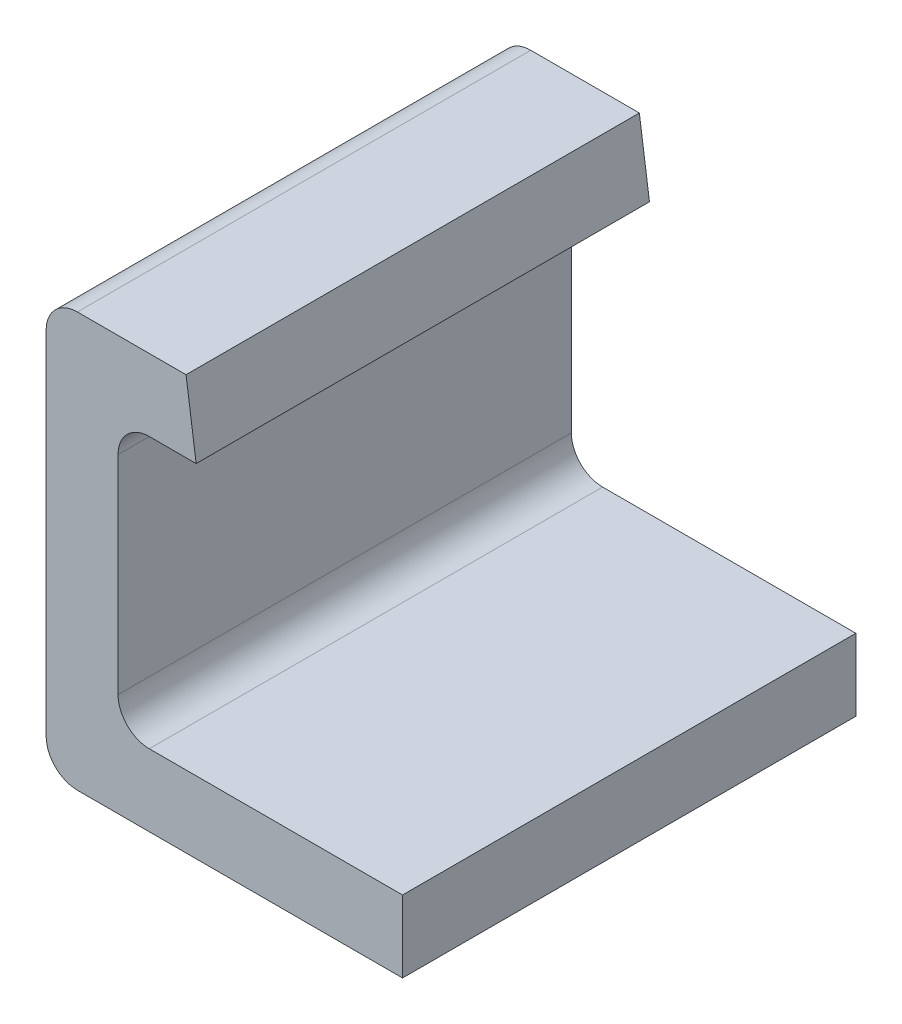
ISO-10303-21;
HEADER;
FILE_DESCRIPTION(('STEP AP214'),'2;1');
FILE_NAME('part.step','',(''),(''),'','','');
FILE_SCHEMA(('AUTOMOTIVE_DESIGN { 1 0 10303 214 1 1 1 1 }'));
ENDSEC;
DATA;
#1=APPLICATION_CONTEXT('core data for automotive mechanical design processes');
#2=APPLICATION_PROTOCOL_DEFINITION('international standard','automotive_design',2000,#1);
#3=PRODUCT_CONTEXT('',#1,'mechanical');
#4=PRODUCT('Part','Part','',(#3));
#5=PRODUCT_RELATED_PRODUCT_CATEGORY('part','',(#4));
#6=PRODUCT_DEFINITION_FORMATION('','',#4);
#7=PRODUCT_DEFINITION_CONTEXT('part definition',#1,'design');
#8=PRODUCT_DEFINITION('design','',#6,#7);
#9=PRODUCT_DEFINITION_SHAPE('','',#8);
#10=(LENGTH_UNIT() NAMED_UNIT(*) SI_UNIT(.MILLI.,.METRE.));
#11=(NAMED_UNIT(*) PLANE_ANGLE_UNIT() SI_UNIT($,.RADIAN.));
#12=(NAMED_UNIT(*) SI_UNIT($,.STERADIAN.) SOLID_ANGLE_UNIT());
#13=UNCERTAINTY_MEASURE_WITH_UNIT(LENGTH_MEASURE(1.E-05),#10,'distance_accuracy_value','');
#14=(GEOMETRIC_REPRESENTATION_CONTEXT(3) GLOBAL_UNCERTAINTY_ASSIGNED_CONTEXT((#13)) GLOBAL_UNIT_ASSIGNED_CONTEXT((#10,
#11,#12)) REPRESENTATION_CONTEXT('',''));
#15=CARTESIAN_POINT('',(0.,0.,0.));
#16=DIRECTION('',(0.,0.,1.));
#17=DIRECTION('',(1.,0.,0.));
#18=AXIS2_PLACEMENT_3D('',#15,#16,#17);
#19=CARTESIAN_POINT('',(0.10625,0.3325,0.));
#20=DIRECTION('',(0.,0.,-1.));
#21=DIRECTION('',(-1.,0.,0.));
#22=AXIS2_PLACEMENT_3D('',#19,#20,#21);
#23=CYLINDRICAL_SURFACE('',#22,0.1);
#24=DIRECTION('',(0.,0.,1.));
#25=VECTOR('',#24,1.);
#26=CARTESIAN_POINT('',(0.10625,0.4325,0.));
#27=LINE('',#26,#25);
#28=CARTESIAN_POINT('',(0.10625,0.4325,-1.45));
#29=VERTEX_POINT('',#28);
#30=CARTESIAN_POINT('',(0.10625,0.4325,0.));
#31=VERTEX_POINT('',#30);
#32=EDGE_CURVE('E213',#29,#31,#27,.T.);
#33=ORIENTED_EDGE('',*,*,#32,.T.);
#34=CARTESIAN_POINT('',(0.10625,0.3325,0.));
#35=DIRECTION('',(0.,0.,-1.));
#36=DIRECTION('',(-1.,0.,0.));
#37=AXIS2_PLACEMENT_3D('',#34,#35,#36);
#38=CIRCLE('',#37,0.1);
#39=CARTESIAN_POINT('',(0.00625,0.3325,0.));
#40=VERTEX_POINT('',#39);
#41=EDGE_CURVE('E20',#40,#31,#38,.T.);
#42=ORIENTED_EDGE('',*,*,#41,.F.);
#43=DIRECTION('',(0.,0.,1.));
#44=VECTOR('',#43,1.);
#45=CARTESIAN_POINT('',(0.00625,0.3325,0.));
#46=LINE('',#45,#44);
#47=CARTESIAN_POINT('',(0.00625,0.3325,-1.45));
#48=VERTEX_POINT('',#47);
#49=EDGE_CURVE('E216',#40,#48,#46,.F.);
#50=ORIENTED_EDGE('',*,*,#49,.T.);
#51=CARTESIAN_POINT('',(0.10625,0.3325,-1.45));
#52=DIRECTION('',(0.,0.,-1.));
#53=DIRECTION('',(-1.,0.,0.));
#54=AXIS2_PLACEMENT_3D('',#51,#52,#53);
#55=CIRCLE('',#54,0.1);
#56=EDGE_CURVE('E225',#29,#48,#55,.F.);
#57=ORIENTED_EDGE('',*,*,#56,.F.);
#58=EDGE_LOOP('',(#33,#42,#50,#57));
#59=FACE_BOUND('',#58,.T.);
#60=ADVANCED_FACE('F17',(#59),#23,.F.);
#61=CARTESIAN_POINT('',(-0.22375,0.4325,0.));
#62=DIRECTION('',(0.,1.,0.));
#63=DIRECTION('',(0.,0.,1.));
#64=AXIS2_PLACEMENT_3D('',#61,#62,#63);
#65=PLANE('',#64);
#66=DIRECTION('',(1.,0.,0.));
#67=VECTOR('',#66,1.);
#68=CARTESIAN_POINT('',(-0.22375,0.4325,-1.45));
#69=LINE('',#68,#67);
#70=CARTESIAN_POINT('',(0.256074391981687,0.432499999999956,-1.45));
#71=VERTEX_POINT('',#70);
#72=EDGE_CURVE('E94',#71,#29,#69,.F.);
#73=ORIENTED_EDGE('',*,*,#72,.F.);
#74=DIRECTION('',(0.,0.,1.));
#75=VECTOR('',#74,1.);
#76=CARTESIAN_POINT('',(0.25607439198153,0.432499999999934,-1.45));
#77=LINE('',#76,#75);
#78=CARTESIAN_POINT('',(0.256074391981687,0.432499999999956,0.));
#79=VERTEX_POINT('',#78);
#80=EDGE_CURVE('E204',#71,#79,#77,.T.);
#81=ORIENTED_EDGE('',*,*,#80,.T.);
#82=DIRECTION('',(1.,0.,0.));
#83=VECTOR('',#82,1.);
#84=CARTESIAN_POINT('',(-0.22375,0.4325,0.));
#85=LINE('',#84,#83);
#86=EDGE_CURVE('E221',#31,#79,#85,.T.);
#87=ORIENTED_EDGE('',*,*,#86,.F.);
#88=ORIENTED_EDGE('',*,*,#32,.F.);
#89=EDGE_LOOP('',(#73,#81,#87,#88));
#90=FACE_BOUND('',#89,.T.);
#91=ADVANCED_FACE('F239',(#90),#65,.F.);
#92=CARTESIAN_POINT('',(0.00625,-0.6625,0.));
#93=DIRECTION('',(-1.,0.,0.));
#94=DIRECTION('',(0.,0.,1.));
#95=AXIS2_PLACEMENT_3D('',#92,#93,#94);
#96=PLANE('',#95);
#97=DIRECTION('',(0.,1.,0.));
#98=VECTOR('',#97,1.);
#99=CARTESIAN_POINT('',(0.00625,-0.6625,0.));
#100=LINE('',#99,#98);
#101=CARTESIAN_POINT('',(0.00624999999999999,-0.3325,0.));
#102=VERTEX_POINT('',#101);
#103=EDGE_CURVE('E212',#102,#40,#100,.T.);
#104=ORIENTED_EDGE('',*,*,#103,.F.);
#105=DIRECTION('',(0.,0.,-1.));
#106=VECTOR('',#105,1.);
#107=CARTESIAN_POINT('',(0.00624999999999998,-0.3325,0.));
#108=LINE('',#107,#106);
#109=CARTESIAN_POINT('',(0.00624999999999999,-0.3325,-1.45));
#110=VERTEX_POINT('',#109);
#111=EDGE_CURVE('E207',#102,#110,#108,.T.);
#112=ORIENTED_EDGE('',*,*,#111,.T.);
#113=DIRECTION('',(0.,1.,0.));
#114=VECTOR('',#113,1.);
#115=CARTESIAN_POINT('',(0.00625,-0.6625,-1.45));
#116=LINE('',#115,#114);
#117=EDGE_CURVE('E210',#48,#110,#116,.F.);
#118=ORIENTED_EDGE('',*,*,#117,.F.);
#119=ORIENTED_EDGE('',*,*,#49,.F.);
#120=EDGE_LOOP('',(#104,#112,#118,#119));
#121=FACE_BOUND('',#120,.T.);
#122=ADVANCED_FACE('F290',(#121),#96,.F.);
#123=CARTESIAN_POINT('',(0.22375,0.6625,-1.45));
#124=DIRECTION('',(-0.990268068741588,-0.139173100959942,0.));
#125=DIRECTION('',(0.139173100959942,-0.990268068741588,0.));
#126=AXIS2_PLACEMENT_3D('',#123,#124,#125);
#127=PLANE('',#126);
#128=DIRECTION('',(0.,0.,-1.));
#129=VECTOR('',#128,1.);
#130=CARTESIAN_POINT('',(0.22375,0.6625,0.));
#131=LINE('',#130,#129);
#132=CARTESIAN_POINT('',(0.22375,0.6625,-1.45));
#133=VERTEX_POINT('',#132);
#134=CARTESIAN_POINT('',(0.22375,0.6625,0.));
#135=VERTEX_POINT('',#134);
#136=EDGE_CURVE('E124',#133,#135,#131,.F.);
#137=ORIENTED_EDGE('',*,*,#136,.T.);
#138=DIRECTION('',(0.139173100959942,-0.990268068741588,0.));
#139=VECTOR('',#138,1.);
#140=CARTESIAN_POINT('',(0.22375,0.6625,0.));
#141=LINE('',#140,#139);
#142=EDGE_CURVE('E200',#79,#135,#141,.F.);
#143=ORIENTED_EDGE('',*,*,#142,.F.);
#144=ORIENTED_EDGE('',*,*,#80,.F.);
#145=DIRECTION('',(0.139173100959942,-0.990268068741588,0.));
#146=VECTOR('',#145,1.);
#147=CARTESIAN_POINT('',(0.22375,0.6625,-1.45));
#148=LINE('',#147,#146);
#149=EDGE_CURVE('E196',#133,#71,#148,.T.);
#150=ORIENTED_EDGE('',*,*,#149,.F.);
#151=EDGE_LOOP('',(#137,#143,#144,#150));
#152=FACE_BOUND('',#151,.T.);
#153=ADVANCED_FACE('F245',(#152),#127,.F.);
#154=CARTESIAN_POINT('',(0.10625,-0.3325,0.));
#155=DIRECTION('',(0.,0.,-1.));
#156=DIRECTION('',(-1.,0.,0.));
#157=AXIS2_PLACEMENT_3D('',#154,#155,#156);
#158=CYLINDRICAL_SURFACE('',#157,0.1);
#159=ORIENTED_EDGE('',*,*,#111,.F.);
#160=CARTESIAN_POINT('',(0.10625,-0.3325,0.));
#161=DIRECTION('',(0.,0.,-1.));
#162=DIRECTION('',(-1.,0.,0.));
#163=AXIS2_PLACEMENT_3D('',#160,#161,#162);
#164=CIRCLE('',#163,0.1);
#165=CARTESIAN_POINT('',(0.10625,-0.4325,0.));
#166=VERTEX_POINT('',#165);
#167=EDGE_CURVE('E199',#166,#102,#164,.T.);
#168=ORIENTED_EDGE('',*,*,#167,.F.);
#169=DIRECTION('',(0.,0.,-1.));
#170=VECTOR('',#169,1.);
#171=CARTESIAN_POINT('',(0.10625,-0.4325,0.));
#172=LINE('',#171,#170);
#173=CARTESIAN_POINT('',(0.10625,-0.4325,-1.45));
#174=VERTEX_POINT('',#173);
#175=EDGE_CURVE('E133',#166,#174,#172,.T.);
#176=ORIENTED_EDGE('',*,*,#175,.T.);
#177=CARTESIAN_POINT('',(0.10625,-0.3325,-1.45));
#178=DIRECTION('',(0.,0.,-1.));
#179=DIRECTION('',(-1.,0.,0.));
#180=AXIS2_PLACEMENT_3D('',#177,#178,#179);
#181=CIRCLE('',#180,0.1);
#182=EDGE_CURVE('E193',#110,#174,#181,.F.);
#183=ORIENTED_EDGE('',*,*,#182,.F.);
#184=EDGE_LOOP('',(#159,#168,#176,#183));
#185=FACE_BOUND('',#184,.T.);
#186=ADVANCED_FACE('F284',(#185),#158,.F.);
#187=CARTESIAN_POINT('',(0.91625,-0.6625,0.));
#188=DIRECTION('',(-1.,0.,0.));
#189=DIRECTION('',(0.,0.,1.));
#190=AXIS2_PLACEMENT_3D('',#187,#188,#189);
#191=PLANE('',#190);
#192=DIRECTION('',(0.,0.,1.));
#193=VECTOR('',#192,1.);
#194=CARTESIAN_POINT('',(0.91625,-0.6625,0.));
#195=LINE('',#194,#193);
#196=CARTESIAN_POINT('',(0.91625,-0.6625,0.));
#197=VERTEX_POINT('',#196);
#198=CARTESIAN_POINT('',(0.91625,-0.6625,-1.45));
#199=VERTEX_POINT('',#198);
#200=EDGE_CURVE('E170',#197,#199,#195,.F.);
#201=ORIENTED_EDGE('',*,*,#200,.T.);
#202=DIRECTION('',(0.,1.,0.));
#203=VECTOR('',#202,1.);
#204=CARTESIAN_POINT('',(0.91625,-0.6625,-1.45));
#205=LINE('',#204,#203);
#206=CARTESIAN_POINT('',(0.91625,-0.4325,-1.45));
#207=VERTEX_POINT('',#206);
#208=EDGE_CURVE('E125',#207,#199,#205,.F.);
#209=ORIENTED_EDGE('',*,*,#208,.F.);
#210=DIRECTION('',(0.,0.,-1.));
#211=VECTOR('',#210,1.);
#212=CARTESIAN_POINT('',(0.91625,-0.4325,0.));
#213=LINE('',#212,#211);
#214=CARTESIAN_POINT('',(0.91625,-0.4325,0.));
#215=VERTEX_POINT('',#214);
#216=EDGE_CURVE('E128',#207,#215,#213,.F.);
#217=ORIENTED_EDGE('',*,*,#216,.T.);
#218=DIRECTION('',(0.,1.,0.));
#219=VECTOR('',#218,1.);
#220=CARTESIAN_POINT('',(0.91625,-0.6625,0.));
#221=LINE('',#220,#219);
#222=EDGE_CURVE('E113',#197,#215,#221,.T.);
#223=ORIENTED_EDGE('',*,*,#222,.F.);
#224=EDGE_LOOP('',(#201,#209,#217,#223));
#225=FACE_BOUND('',#224,.T.);
#226=ADVANCED_FACE('F129',(#225),#191,.F.);
#227=CARTESIAN_POINT('',(0.22375,0.6625,0.));
#228=DIRECTION('',(0.,-1.,0.));
#229=DIRECTION('',(0.,0.,-1.));
#230=AXIS2_PLACEMENT_3D('',#227,#228,#229);
#231=PLANE('',#230);
#232=DIRECTION('',(1.,0.,0.));
#233=VECTOR('',#232,1.);
#234=CARTESIAN_POINT('',(0.22375,0.6625,0.));
#235=LINE('',#234,#233);
#236=CARTESIAN_POINT('',(-0.12375,0.6625,0.));
#237=VERTEX_POINT('',#236);
#238=EDGE_CURVE('E134',#135,#237,#235,.F.);
#239=ORIENTED_EDGE('',*,*,#238,.F.);
#240=ORIENTED_EDGE('',*,*,#136,.F.);
#241=DIRECTION('',(1.,0.,0.));
#242=VECTOR('',#241,1.);
#243=CARTESIAN_POINT('',(0.,0.6625,-1.45));
#244=LINE('',#243,#242);
#245=CARTESIAN_POINT('',(-0.12375,0.6625,-1.45));
#246=VERTEX_POINT('',#245);
#247=EDGE_CURVE('E158',#133,#246,#244,.F.);
#248=ORIENTED_EDGE('',*,*,#247,.T.);
#249=DIRECTION('',(0.,0.,1.));
#250=VECTOR('',#249,1.);
#251=CARTESIAN_POINT('',(-0.12375,0.6625,0.));
#252=LINE('',#251,#250);
#253=EDGE_CURVE('E143',#237,#246,#252,.F.);
#254=ORIENTED_EDGE('',*,*,#253,.F.);
#255=EDGE_LOOP('',(#239,#240,#248,#254));
#256=FACE_BOUND('',#255,.T.);
#257=ADVANCED_FACE('F248',(#256),#231,.F.);
#258=CARTESIAN_POINT('',(0.91625,-0.4325,0.));
#259=DIRECTION('',(0.,-1.,0.));
#260=DIRECTION('',(0.,0.,-1.));
#261=AXIS2_PLACEMENT_3D('',#258,#259,#260);
#262=PLANE('',#261);
#263=DIRECTION('',(1.,0.,0.));
#264=VECTOR('',#263,1.);
#265=CARTESIAN_POINT('',(0.,-0.4325,0.));
#266=LINE('',#265,#264);
#267=EDGE_CURVE('E118',#215,#166,#266,.F.);
#268=ORIENTED_EDGE('',*,*,#267,.F.);
#269=ORIENTED_EDGE('',*,*,#216,.F.);
#270=DIRECTION('',(1.,0.,0.));
#271=VECTOR('',#270,1.);
#272=CARTESIAN_POINT('',(0.,-0.4325,-1.45));
#273=LINE('',#272,#271);
#274=EDGE_CURVE('E161',#207,#174,#273,.F.);
#275=ORIENTED_EDGE('',*,*,#274,.T.);
#276=ORIENTED_EDGE('',*,*,#175,.F.);
#277=EDGE_LOOP('',(#268,#269,#275,#276));
#278=FACE_BOUND('',#277,.T.);
#279=ADVANCED_FACE('F137',(#278),#262,.F.);
#280=CARTESIAN_POINT('',(-0.22375,-0.6625,0.));
#281=DIRECTION('',(0.,1.,0.));
#282=DIRECTION('',(0.,0.,1.));
#283=AXIS2_PLACEMENT_3D('',#280,#281,#282);
#284=PLANE('',#283);
#285=DIRECTION('',(1.,0.,0.));
#286=VECTOR('',#285,1.);
#287=CARTESIAN_POINT('',(0.,-0.6625,-1.45));
#288=LINE('',#287,#286);
#289=CARTESIAN_POINT('',(-0.12375,-0.6625,-1.45));
#290=VERTEX_POINT('',#289);
#291=EDGE_CURVE('E165',#290,#199,#288,.T.);
#292=ORIENTED_EDGE('',*,*,#291,.T.);
#293=ORIENTED_EDGE('',*,*,#200,.F.);
#294=DIRECTION('',(1.,0.,0.));
#295=VECTOR('',#294,1.);
#296=CARTESIAN_POINT('',(0.,-0.6625,0.));
#297=LINE('',#296,#295);
#298=CARTESIAN_POINT('',(-0.12375,-0.6625,0.));
#299=VERTEX_POINT('',#298);
#300=EDGE_CURVE('E120',#299,#197,#297,.T.);
#301=ORIENTED_EDGE('',*,*,#300,.F.);
#302=DIRECTION('',(0.,0.,1.));
#303=VECTOR('',#302,1.);
#304=CARTESIAN_POINT('',(-0.12375,-0.6625,0.));
#305=LINE('',#304,#303);
#306=EDGE_CURVE('E173',#290,#299,#305,.T.);
#307=ORIENTED_EDGE('',*,*,#306,.F.);
#308=EDGE_LOOP('',(#292,#293,#301,#307));
#309=FACE_BOUND('',#308,.T.);
#310=ADVANCED_FACE('F274',(#309),#284,.F.);
#311=CARTESIAN_POINT('',(0.,0.5475,-1.45));
#312=DIRECTION('',(0.,0.,1.));
#313=DIRECTION('',(1.,0.,0.));
#314=AXIS2_PLACEMENT_3D('',#311,#312,#313);
#315=PLANE('',#314);
#316=DIRECTION('',(0.,1.,0.));
#317=VECTOR('',#316,1.);
#318=CARTESIAN_POINT('',(-0.22375,0.6625,-1.45));
#319=LINE('',#318,#317);
#320=CARTESIAN_POINT('',(-0.22375,-0.5625,-1.45));
#321=VERTEX_POINT('',#320);
#322=CARTESIAN_POINT('',(-0.22375,0.5625,-1.45));
#323=VERTEX_POINT('',#322);
#324=EDGE_CURVE('E153',#321,#323,#319,.T.);
#325=ORIENTED_EDGE('',*,*,#324,.T.);
#326=CARTESIAN_POINT('',(-0.12375,0.5625,-1.45));
#327=DIRECTION('',(0.,0.,1.));
#328=DIRECTION('',(1.,0.,0.));
#329=AXIS2_PLACEMENT_3D('',#326,#327,#328);
#330=CIRCLE('',#329,0.1);
#331=EDGE_CURVE('E160',#246,#323,#330,.T.);
#332=ORIENTED_EDGE('',*,*,#331,.F.);
#333=ORIENTED_EDGE('',*,*,#247,.F.);
#334=ORIENTED_EDGE('',*,*,#149,.T.);
#335=ORIENTED_EDGE('',*,*,#72,.T.);
#336=ORIENTED_EDGE('',*,*,#56,.T.);
#337=ORIENTED_EDGE('',*,*,#117,.T.);
#338=ORIENTED_EDGE('',*,*,#182,.T.);
#339=ORIENTED_EDGE('',*,*,#274,.F.);
#340=ORIENTED_EDGE('',*,*,#208,.T.);
#341=ORIENTED_EDGE('',*,*,#291,.F.);
#342=CARTESIAN_POINT('',(-0.12375,-0.5625,-1.45));
#343=DIRECTION('',(0.,0.,1.));
#344=DIRECTION('',(1.,0.,0.));
#345=AXIS2_PLACEMENT_3D('',#342,#343,#344);
#346=CIRCLE('',#345,0.1);
#347=EDGE_CURVE('E141',#321,#290,#346,.T.);
#348=ORIENTED_EDGE('',*,*,#347,.F.);
#349=EDGE_LOOP('',(#325,#332,#333,#334,#335,#336,#337,#338,#339,#340,#341,#348));
#350=FACE_BOUND('',#349,.T.);
#351=ADVANCED_FACE('F240',(#350),#315,.F.);
#352=CARTESIAN_POINT('',(-0.12375,0.5625,0.));
#353=DIRECTION('',(0.,0.,1.));
#354=DIRECTION('',(1.,0.,0.));
#355=AXIS2_PLACEMENT_3D('',#352,#353,#354);
#356=CYLINDRICAL_SURFACE('',#355,0.1);
#357=CARTESIAN_POINT('',(-0.12375,0.5625,0.));
#358=DIRECTION('',(0.,0.,1.));
#359=DIRECTION('',(1.,0.,0.));
#360=AXIS2_PLACEMENT_3D('',#357,#358,#359);
#361=CIRCLE('',#360,0.1);
#362=CARTESIAN_POINT('',(-0.22375,0.5625,0.));
#363=VERTEX_POINT('',#362);
#364=EDGE_CURVE('E139',#237,#363,#361,.T.);
#365=ORIENTED_EDGE('',*,*,#364,.F.);
#366=ORIENTED_EDGE('',*,*,#253,.T.);
#367=ORIENTED_EDGE('',*,*,#331,.T.);
#368=DIRECTION('',(0.,0.,1.));
#369=VECTOR('',#368,1.);
#370=CARTESIAN_POINT('',(-0.22375,0.5625,0.));
#371=LINE('',#370,#369);
#372=EDGE_CURVE('E150',#323,#363,#371,.T.);
#373=ORIENTED_EDGE('',*,*,#372,.T.);
#374=EDGE_LOOP('',(#365,#366,#367,#373));
#375=FACE_BOUND('',#374,.T.);
#376=ADVANCED_FACE('F256',(#375),#356,.T.);
#377=CARTESIAN_POINT('',(0.,0.5475,0.));
#378=DIRECTION('',(0.,0.,1.));
#379=DIRECTION('',(1.,0.,0.));
#380=AXIS2_PLACEMENT_3D('',#377,#378,#379);
#381=PLANE('',#380);
#382=ORIENTED_EDGE('',*,*,#364,.T.);
#383=DIRECTION('',(0.,1.,0.));
#384=VECTOR('',#383,1.);
#385=CARTESIAN_POINT('',(-0.22375,0.6625,0.));
#386=LINE('',#385,#384);
#387=CARTESIAN_POINT('',(-0.22375,-0.5625,0.));
#388=VERTEX_POINT('',#387);
#389=EDGE_CURVE('E26',#363,#388,#386,.F.);
#390=ORIENTED_EDGE('',*,*,#389,.T.);
#391=CARTESIAN_POINT('',(-0.12375,-0.5625,0.));
#392=DIRECTION('',(0.,0.,1.));
#393=DIRECTION('',(1.,0.,0.));
#394=AXIS2_PLACEMENT_3D('',#391,#392,#393);
#395=CIRCLE('',#394,0.1);
#396=EDGE_CURVE('E34',#299,#388,#395,.F.);
#397=ORIENTED_EDGE('',*,*,#396,.F.);
#398=ORIENTED_EDGE('',*,*,#300,.T.);
#399=ORIENTED_EDGE('',*,*,#222,.T.);
#400=ORIENTED_EDGE('',*,*,#267,.T.);
#401=ORIENTED_EDGE('',*,*,#167,.T.);
#402=ORIENTED_EDGE('',*,*,#103,.T.);
#403=ORIENTED_EDGE('',*,*,#41,.T.);
#404=ORIENTED_EDGE('',*,*,#86,.T.);
#405=ORIENTED_EDGE('',*,*,#142,.T.);
#406=ORIENTED_EDGE('',*,*,#238,.T.);
#407=EDGE_LOOP('',(#382,#390,#397,#398,#399,#400,#401,#402,#403,#404,#405,#406));
#408=FACE_BOUND('',#407,.T.);
#409=ADVANCED_FACE('F115',(#408),#381,.T.);
#410=CARTESIAN_POINT('',(-0.12375,-0.5625,0.));
#411=DIRECTION('',(0.,0.,1.));
#412=DIRECTION('',(1.,0.,0.));
#413=AXIS2_PLACEMENT_3D('',#410,#411,#412);
#414=CYLINDRICAL_SURFACE('',#413,0.1);
#415=ORIENTED_EDGE('',*,*,#396,.T.);
#416=DIRECTION('',(0.,0.,1.));
#417=VECTOR('',#416,1.);
#418=CARTESIAN_POINT('',(-0.22375,-0.5625,0.));
#419=LINE('',#418,#417);
#420=EDGE_CURVE('E11',#388,#321,#419,.F.);
#421=ORIENTED_EDGE('',*,*,#420,.T.);
#422=ORIENTED_EDGE('',*,*,#347,.T.);
#423=ORIENTED_EDGE('',*,*,#306,.T.);
#424=EDGE_LOOP('',(#415,#421,#422,#423));
#425=FACE_BOUND('',#424,.T.);
#426=ADVANCED_FACE('F259',(#425),#414,.T.);
#427=CARTESIAN_POINT('',(-0.22375,0.6625,0.));
#428=DIRECTION('',(1.,0.,0.));
#429=DIRECTION('',(0.,1.,0.));
#430=AXIS2_PLACEMENT_3D('',#427,#428,#429);
#431=PLANE('',#430);
#432=ORIENTED_EDGE('',*,*,#389,.F.);
#433=ORIENTED_EDGE('',*,*,#372,.F.);
#434=ORIENTED_EDGE('',*,*,#324,.F.);
#435=ORIENTED_EDGE('',*,*,#420,.F.);
#436=EDGE_LOOP('',(#432,#433,#434,#435));
#437=FACE_BOUND('',#436,.T.);
#438=ADVANCED_FACE('F255',(#437),#431,.F.);
#439=CLOSED_SHELL('',(#60,#91,#122,#153,#186,#226,#257,#279,#310,#351,#376,#409,#426,#438));
#440=MANIFOLD_SOLID_BREP('B1',#439);
#441=ADVANCED_BREP_SHAPE_REPRESENTATION('',(#18,#440),#14);
#442=SHAPE_DEFINITION_REPRESENTATION(#9,#441);
ENDSEC;
END-ISO-10303-21;
